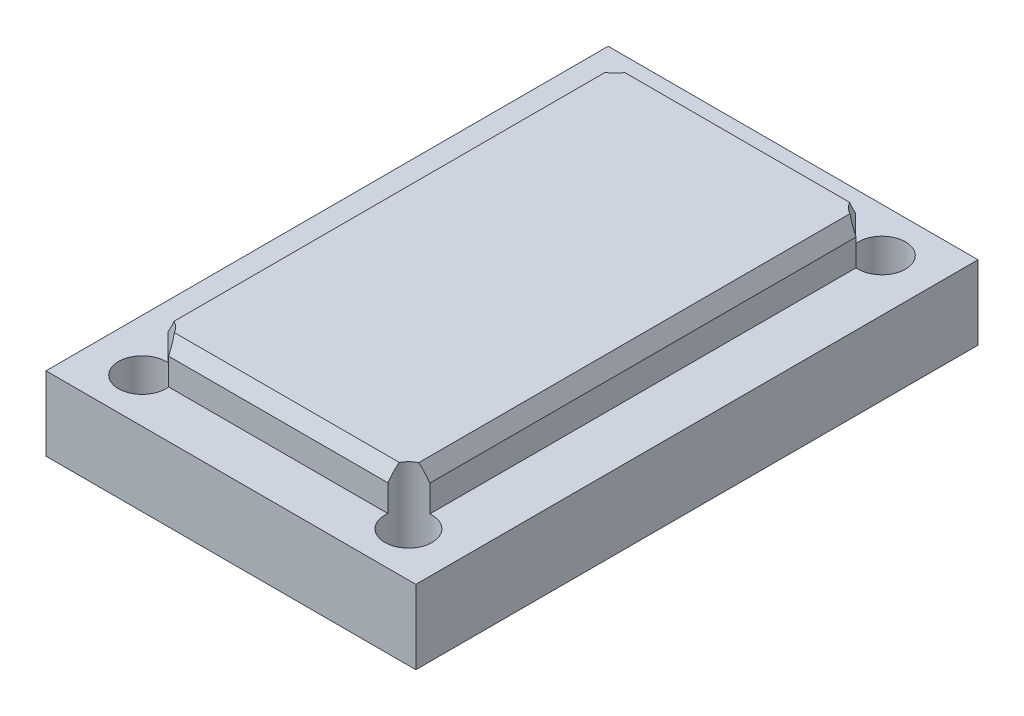
ISO-10303-21;
HEADER;
FILE_DESCRIPTION(('STEP AP214'),'2;1');
FILE_NAME('part.step','',(''),(''),'','','');
FILE_SCHEMA(('AUTOMOTIVE_DESIGN { 1 0 10303 214 1 1 1 1 }'));
ENDSEC;
DATA;
#1=APPLICATION_CONTEXT('core data for automotive mechanical design processes');
#2=APPLICATION_PROTOCOL_DEFINITION('international standard','automotive_design',2000,#1);
#3=PRODUCT_CONTEXT('',#1,'mechanical');
#4=PRODUCT('Part','Part','',(#3));
#5=PRODUCT_RELATED_PRODUCT_CATEGORY('part','',(#4));
#6=PRODUCT_DEFINITION_FORMATION('','',#4);
#7=PRODUCT_DEFINITION_CONTEXT('part definition',#1,'design');
#8=PRODUCT_DEFINITION('design','',#6,#7);
#9=PRODUCT_DEFINITION_SHAPE('','',#8);
#10=(LENGTH_UNIT() NAMED_UNIT(*) SI_UNIT(.MILLI.,.METRE.));
#11=(NAMED_UNIT(*) PLANE_ANGLE_UNIT() SI_UNIT($,.RADIAN.));
#12=(NAMED_UNIT(*) SI_UNIT($,.STERADIAN.) SOLID_ANGLE_UNIT());
#13=UNCERTAINTY_MEASURE_WITH_UNIT(LENGTH_MEASURE(1.E-05),#10,'distance_accuracy_value','');
#14=(GEOMETRIC_REPRESENTATION_CONTEXT(3) GLOBAL_UNCERTAINTY_ASSIGNED_CONTEXT((#13)) GLOBAL_UNIT_ASSIGNED_CONTEXT((#10,
#11,#12)) REPRESENTATION_CONTEXT('',''));
#15=CARTESIAN_POINT('',(0.,0.,0.));
#16=DIRECTION('',(0.,0.,1.));
#17=DIRECTION('',(1.,0.,0.));
#18=AXIS2_PLACEMENT_3D('',#15,#16,#17);
#19=CARTESIAN_POINT('',(0.,5.,0.));
#20=DIRECTION('',(0.,1.,0.));
#21=DIRECTION('',(0.,0.,1.));
#22=AXIS2_PLACEMENT_3D('',#19,#20,#21);
#23=PLANE('',#22);
#24=CARTESIAN_POINT('',(-9.,5.,16.));
#25=DIRECTION('',(0.,1.,0.));
#26=DIRECTION('',(0.,0.,1.));
#27=AXIS2_PLACEMENT_3D('',#24,#25,#26);
#28=CIRCLE('',#27,1.6);
#29=CARTESIAN_POINT('',(-8.85,5.,14.4070467677926));
#30=VERTEX_POINT('',#29);
#31=CARTESIAN_POINT('',(-7.41254921336124,5.,15.8));
#32=VERTEX_POINT('',#31);
#33=EDGE_CURVE('E284',#30,#32,#28,.T.);
#34=ORIENTED_EDGE('',*,*,#33,.F.);
#35=DIRECTION('',(0.,0.,1.));
#36=VECTOR('',#35,1.);
#37=CARTESIAN_POINT('',(-8.85,5.,-15.8));
#38=LINE('',#37,#36);
#39=CARTESIAN_POINT('',(-8.85,5.,-14.4070467677926));
#40=VERTEX_POINT('',#39);
#41=EDGE_CURVE('E301',#40,#30,#38,.T.);
#42=ORIENTED_EDGE('',*,*,#41,.F.);
#43=CARTESIAN_POINT('',(-9.,5.,-16.));
#44=DIRECTION('',(0.,1.,0.));
#45=DIRECTION('',(0.,0.,1.));
#46=AXIS2_PLACEMENT_3D('',#43,#44,#45);
#47=CIRCLE('',#46,1.6);
#48=CARTESIAN_POINT('',(-7.41254921336125,5.,-15.8));
#49=VERTEX_POINT('',#48);
#50=EDGE_CURVE('E174',#49,#40,#47,.T.);
#51=ORIENTED_EDGE('',*,*,#50,.F.);
#52=DIRECTION('',(-1.,0.,0.));
#53=VECTOR('',#52,1.);
#54=CARTESIAN_POINT('',(8.85,5.,-15.8));
#55=LINE('',#54,#53);
#56=CARTESIAN_POINT('',(7.41254921336124,5.,-15.8));
#57=VERTEX_POINT('',#56);
#58=EDGE_CURVE('E152',#57,#49,#55,.T.);
#59=ORIENTED_EDGE('',*,*,#58,.F.);
#60=CARTESIAN_POINT('',(8.99999999999999,5.,-16.));
#61=DIRECTION('',(0.,1.,0.));
#62=DIRECTION('',(0.,0.,1.));
#63=AXIS2_PLACEMENT_3D('',#60,#61,#62);
#64=CIRCLE('',#63,1.6);
#65=CARTESIAN_POINT('',(8.85,5.,-14.4070467677926));
#66=VERTEX_POINT('',#65);
#67=EDGE_CURVE('E157',#66,#57,#64,.T.);
#68=ORIENTED_EDGE('',*,*,#67,.F.);
#69=DIRECTION('',(0.,0.,-1.));
#70=VECTOR('',#69,1.);
#71=CARTESIAN_POINT('',(8.85,5.,-15.8));
#72=LINE('',#71,#70);
#73=CARTESIAN_POINT('',(8.85,5.,14.4070467677926));
#74=VERTEX_POINT('',#73);
#75=EDGE_CURVE('E176',#74,#66,#72,.T.);
#76=ORIENTED_EDGE('',*,*,#75,.F.);
#77=CARTESIAN_POINT('',(9.,5.,16.));
#78=DIRECTION('',(0.,1.,0.));
#79=DIRECTION('',(0.,0.,1.));
#80=AXIS2_PLACEMENT_3D('',#77,#78,#79);
#81=CIRCLE('',#80,1.6);
#82=CARTESIAN_POINT('',(7.41254921336124,5.,15.8));
#83=VERTEX_POINT('',#82);
#84=EDGE_CURVE('E296',#83,#74,#81,.T.);
#85=ORIENTED_EDGE('',*,*,#84,.F.);
#86=DIRECTION('',(1.,0.,0.));
#87=VECTOR('',#86,1.);
#88=CARTESIAN_POINT('',(8.85,5.,15.8));
#89=LINE('',#88,#87);
#90=EDGE_CURVE('E181',#32,#83,#89,.T.);
#91=ORIENTED_EDGE('',*,*,#90,.F.);
#92=EDGE_LOOP('',(#34,#42,#51,#59,#68,#76,#85,#91));
#93=FACE_BOUND('',#92,.T.);
#94=DIRECTION('',(0.,0.,1.));
#95=VECTOR('',#94,1.);
#96=CARTESIAN_POINT('',(-12.5,5.,19.));
#97=LINE('',#96,#95);
#98=CARTESIAN_POINT('',(-12.5,5.,-19.));
#99=VERTEX_POINT('',#98);
#100=CARTESIAN_POINT('',(-12.5,5.,19.));
#101=VERTEX_POINT('',#100);
#102=EDGE_CURVE('E185',#99,#101,#97,.T.);
#103=ORIENTED_EDGE('',*,*,#102,.T.);
#104=DIRECTION('',(1.,0.,0.));
#105=VECTOR('',#104,1.);
#106=CARTESIAN_POINT('',(12.5,5.,19.));
#107=LINE('',#106,#105);
#108=CARTESIAN_POINT('',(12.5,5.,19.));
#109=VERTEX_POINT('',#108);
#110=EDGE_CURVE('E188',#101,#109,#107,.T.);
#111=ORIENTED_EDGE('',*,*,#110,.T.);
#112=DIRECTION('',(0.,0.,-1.));
#113=VECTOR('',#112,1.);
#114=CARTESIAN_POINT('',(12.5,5.,19.));
#115=LINE('',#114,#113);
#116=CARTESIAN_POINT('',(12.5,5.,-19.));
#117=VERTEX_POINT('',#116);
#118=EDGE_CURVE('E191',#109,#117,#115,.T.);
#119=ORIENTED_EDGE('',*,*,#118,.T.);
#120=DIRECTION('',(-1.,0.,0.));
#121=VECTOR('',#120,1.);
#122=CARTESIAN_POINT('',(12.5,5.,-19.));
#123=LINE('',#122,#121);
#124=EDGE_CURVE('E193',#117,#99,#123,.T.);
#125=ORIENTED_EDGE('',*,*,#124,.T.);
#126=EDGE_LOOP('',(#103,#111,#119,#125));
#127=FACE_BOUND('',#126,.T.);
#128=ADVANCED_FACE('F35',(#93,#127),#23,.T.);
#129=CARTESIAN_POINT('',(-12.5,5.,19.));
#130=DIRECTION('',(1.,0.,0.));
#131=DIRECTION('',(0.,0.,-1.));
#132=AXIS2_PLACEMENT_3D('',#129,#130,#131);
#133=PLANE('',#132);
#134=DIRECTION('',(0.,0.,1.));
#135=VECTOR('',#134,1.);
#136=CARTESIAN_POINT('',(-12.5,0.,19.));
#137=LINE('',#136,#135);
#138=CARTESIAN_POINT('',(-12.5,0.,-19.));
#139=VERTEX_POINT('',#138);
#140=CARTESIAN_POINT('',(-12.5,0.,19.));
#141=VERTEX_POINT('',#140);
#142=EDGE_CURVE('E175',#139,#141,#137,.T.);
#143=ORIENTED_EDGE('',*,*,#142,.T.);
#144=DIRECTION('',(0.,-1.,0.));
#145=VECTOR('',#144,1.);
#146=CARTESIAN_POINT('',(-12.5,5.,19.));
#147=LINE('',#146,#145);
#148=EDGE_CURVE('E208',#101,#141,#147,.T.);
#149=ORIENTED_EDGE('',*,*,#148,.F.);
#150=ORIENTED_EDGE('',*,*,#102,.F.);
#151=DIRECTION('',(0.,-1.,0.));
#152=VECTOR('',#151,1.);
#153=CARTESIAN_POINT('',(-12.5,5.,-19.));
#154=LINE('',#153,#152);
#155=EDGE_CURVE('E194',#99,#139,#154,.T.);
#156=ORIENTED_EDGE('',*,*,#155,.T.);
#157=EDGE_LOOP('',(#143,#149,#150,#156));
#158=FACE_BOUND('',#157,.T.);
#159=ADVANCED_FACE('F328',(#158),#133,.F.);
#160=CARTESIAN_POINT('',(12.5,5.,19.));
#161=DIRECTION('',(0.,0.,-1.));
#162=DIRECTION('',(-1.,0.,0.));
#163=AXIS2_PLACEMENT_3D('',#160,#161,#162);
#164=PLANE('',#163);
#165=DIRECTION('',(1.,0.,0.));
#166=VECTOR('',#165,1.);
#167=CARTESIAN_POINT('',(12.5,0.,19.));
#168=LINE('',#167,#166);
#169=CARTESIAN_POINT('',(12.5,0.,19.));
#170=VERTEX_POINT('',#169);
#171=EDGE_CURVE('E179',#141,#170,#168,.T.);
#172=ORIENTED_EDGE('',*,*,#171,.T.);
#173=DIRECTION('',(0.,-1.,0.));
#174=VECTOR('',#173,1.);
#175=CARTESIAN_POINT('',(12.5,5.,19.));
#176=LINE('',#175,#174);
#177=EDGE_CURVE('E205',#109,#170,#176,.T.);
#178=ORIENTED_EDGE('',*,*,#177,.F.);
#179=ORIENTED_EDGE('',*,*,#110,.F.);
#180=ORIENTED_EDGE('',*,*,#148,.T.);
#181=EDGE_LOOP('',(#172,#178,#179,#180));
#182=FACE_BOUND('',#181,.T.);
#183=ADVANCED_FACE('F333',(#182),#164,.F.);
#184=CARTESIAN_POINT('',(12.5,5.,19.));
#185=DIRECTION('',(-1.,0.,0.));
#186=DIRECTION('',(0.,0.,1.));
#187=AXIS2_PLACEMENT_3D('',#184,#185,#186);
#188=PLANE('',#187);
#189=DIRECTION('',(0.,0.,-1.));
#190=VECTOR('',#189,1.);
#191=CARTESIAN_POINT('',(12.5,0.,19.));
#192=LINE('',#191,#190);
#193=CARTESIAN_POINT('',(12.5,0.,-19.));
#194=VERTEX_POINT('',#193);
#195=EDGE_CURVE('E197',#170,#194,#192,.T.);
#196=ORIENTED_EDGE('',*,*,#195,.T.);
#197=DIRECTION('',(0.,-1.,0.));
#198=VECTOR('',#197,1.);
#199=CARTESIAN_POINT('',(12.5,5.,-19.));
#200=LINE('',#199,#198);
#201=EDGE_CURVE('E202',#117,#194,#200,.T.);
#202=ORIENTED_EDGE('',*,*,#201,.F.);
#203=ORIENTED_EDGE('',*,*,#118,.F.);
#204=ORIENTED_EDGE('',*,*,#177,.T.);
#205=EDGE_LOOP('',(#196,#202,#203,#204));
#206=FACE_BOUND('',#205,.T.);
#207=ADVANCED_FACE('F346',(#206),#188,.F.);
#208=CARTESIAN_POINT('',(12.5,5.,-19.));
#209=DIRECTION('',(0.,0.,1.));
#210=DIRECTION('',(1.,0.,0.));
#211=AXIS2_PLACEMENT_3D('',#208,#209,#210);
#212=PLANE('',#211);
#213=DIRECTION('',(-1.,0.,0.));
#214=VECTOR('',#213,1.);
#215=CARTESIAN_POINT('',(12.5,0.,-19.));
#216=LINE('',#215,#214);
#217=EDGE_CURVE('E189',#194,#139,#216,.T.);
#218=ORIENTED_EDGE('',*,*,#217,.T.);
#219=ORIENTED_EDGE('',*,*,#155,.F.);
#220=ORIENTED_EDGE('',*,*,#124,.F.);
#221=ORIENTED_EDGE('',*,*,#201,.T.);
#222=EDGE_LOOP('',(#218,#219,#220,#221));
#223=FACE_BOUND('',#222,.T.);
#224=ADVANCED_FACE('F342',(#223),#212,.F.);
#225=CARTESIAN_POINT('',(0.,0.,0.));
#226=DIRECTION('',(0.,1.,0.));
#227=DIRECTION('',(0.,0.,1.));
#228=AXIS2_PLACEMENT_3D('',#225,#226,#227);
#229=PLANE('',#228);
#230=CARTESIAN_POINT('',(-9.,0.,16.));
#231=DIRECTION('',(0.,1.,0.));
#232=DIRECTION('',(0.,0.,1.));
#233=AXIS2_PLACEMENT_3D('',#230,#231,#232);
#234=CIRCLE('',#233,1.6);
#235=CARTESIAN_POINT('',(-9.,0.,17.6));
#236=VERTEX_POINT('',#235);
#237=EDGE_CURVE('E158',#236,#236,#234,.T.);
#238=ORIENTED_EDGE('',*,*,#237,.T.);
#239=EDGE_LOOP('',(#238));
#240=FACE_BOUND('',#239,.T.);
#241=CARTESIAN_POINT('',(-9.,0.,-16.));
#242=DIRECTION('',(0.,1.,0.));
#243=DIRECTION('',(0.,0.,1.));
#244=AXIS2_PLACEMENT_3D('',#241,#242,#243);
#245=CIRCLE('',#244,1.6);
#246=CARTESIAN_POINT('',(-9.,0.,-14.4));
#247=VERTEX_POINT('',#246);
#248=EDGE_CURVE('E266',#247,#247,#245,.T.);
#249=ORIENTED_EDGE('',*,*,#248,.T.);
#250=EDGE_LOOP('',(#249));
#251=FACE_BOUND('',#250,.T.);
#252=CARTESIAN_POINT('',(8.99999999999999,0.,-16.));
#253=DIRECTION('',(0.,1.,0.));
#254=DIRECTION('',(0.,0.,1.));
#255=AXIS2_PLACEMENT_3D('',#252,#253,#254);
#256=CIRCLE('',#255,1.6);
#257=CARTESIAN_POINT('',(8.99999999999999,0.,-14.4));
#258=VERTEX_POINT('',#257);
#259=EDGE_CURVE('E273',#258,#258,#256,.T.);
#260=ORIENTED_EDGE('',*,*,#259,.T.);
#261=EDGE_LOOP('',(#260));
#262=FACE_BOUND('',#261,.T.);
#263=CARTESIAN_POINT('',(9.,0.,16.));
#264=DIRECTION('',(0.,1.,0.));
#265=DIRECTION('',(0.,0.,1.));
#266=AXIS2_PLACEMENT_3D('',#263,#264,#265);
#267=CIRCLE('',#266,1.6);
#268=CARTESIAN_POINT('',(9.,0.,17.6));
#269=VERTEX_POINT('',#268);
#270=EDGE_CURVE('E291',#269,#269,#267,.T.);
#271=ORIENTED_EDGE('',*,*,#270,.T.);
#272=EDGE_LOOP('',(#271));
#273=FACE_BOUND('',#272,.T.);
#274=ORIENTED_EDGE('',*,*,#142,.F.);
#275=ORIENTED_EDGE('',*,*,#217,.F.);
#276=ORIENTED_EDGE('',*,*,#195,.F.);
#277=ORIENTED_EDGE('',*,*,#171,.F.);
#278=EDGE_LOOP('',(#274,#275,#276,#277));
#279=FACE_BOUND('',#278,.T.);
#280=ADVANCED_FACE('F339',(#240,#251,#262,#273,#279),#229,.F.);
#281=CARTESIAN_POINT('',(-8.85,7.8,-15.8));
#282=DIRECTION('',(1.,0.,0.));
#283=DIRECTION('',(0.,0.,-1.));
#284=AXIS2_PLACEMENT_3D('',#281,#282,#283);
#285=PLANE('',#284);
#286=DIRECTION('',(0.,1.,0.));
#287=VECTOR('',#286,1.);
#288=CARTESIAN_POINT('',(-8.85,0.,14.4070467677926));
#289=LINE('',#288,#287);
#290=CARTESIAN_POINT('',(-8.85,6.79999999999999,14.4070467677926));
#291=VERTEX_POINT('',#290);
#292=EDGE_CURVE('E246',#30,#291,#289,.T.);
#293=ORIENTED_EDGE('',*,*,#292,.T.);
#294=DIRECTION('',(0.,0.,-1.));
#295=VECTOR('',#294,1.);
#296=CARTESIAN_POINT('',(-8.85,6.79999999999999,-15.8));
#297=LINE('',#296,#295);
#298=CARTESIAN_POINT('',(-8.85,6.79999999999999,-14.4070467677926));
#299=VERTEX_POINT('',#298);
#300=EDGE_CURVE('E43',#291,#299,#297,.T.);
#301=ORIENTED_EDGE('',*,*,#300,.T.);
#302=DIRECTION('',(0.,1.,0.));
#303=VECTOR('',#302,1.);
#304=CARTESIAN_POINT('',(-8.85,0.,-14.4070467677926));
#305=LINE('',#304,#303);
#306=EDGE_CURVE('E245',#299,#40,#305,.F.);
#307=ORIENTED_EDGE('',*,*,#306,.T.);
#308=ORIENTED_EDGE('',*,*,#41,.T.);
#309=EDGE_LOOP('',(#293,#301,#307,#308));
#310=FACE_BOUND('',#309,.T.);
#311=ADVANCED_FACE('F243',(#310),#285,.F.);
#312=CARTESIAN_POINT('',(8.85,7.8,15.8));
#313=DIRECTION('',(0.,0.,-1.));
#314=DIRECTION('',(-1.,0.,0.));
#315=AXIS2_PLACEMENT_3D('',#312,#313,#314);
#316=PLANE('',#315);
#317=DIRECTION('',(0.,1.,0.));
#318=VECTOR('',#317,1.);
#319=CARTESIAN_POINT('',(7.41254921336124,0.,15.8));
#320=LINE('',#319,#318);
#321=CARTESIAN_POINT('',(7.41254921336124,6.8,15.8));
#322=VERTEX_POINT('',#321);
#323=EDGE_CURVE('E299',#83,#322,#320,.T.);
#324=ORIENTED_EDGE('',*,*,#323,.T.);
#325=DIRECTION('',(-1.,0.,0.));
#326=VECTOR('',#325,1.);
#327=CARTESIAN_POINT('',(8.85,6.8,15.8));
#328=LINE('',#327,#326);
#329=CARTESIAN_POINT('',(-7.41254921336124,6.8,15.8));
#330=VERTEX_POINT('',#329);
#331=EDGE_CURVE('E11',#322,#330,#328,.T.);
#332=ORIENTED_EDGE('',*,*,#331,.T.);
#333=DIRECTION('',(0.,1.,0.));
#334=VECTOR('',#333,1.);
#335=CARTESIAN_POINT('',(-7.41254921336124,0.,15.8));
#336=LINE('',#335,#334);
#337=EDGE_CURVE('E253',#330,#32,#336,.F.);
#338=ORIENTED_EDGE('',*,*,#337,.T.);
#339=ORIENTED_EDGE('',*,*,#90,.T.);
#340=EDGE_LOOP('',(#324,#332,#338,#339));
#341=FACE_BOUND('',#340,.T.);
#342=ADVANCED_FACE('F304',(#341),#316,.F.);
#343=CARTESIAN_POINT('',(8.85,7.8,-15.8));
#344=DIRECTION('',(-1.,0.,0.));
#345=DIRECTION('',(0.,0.,1.));
#346=AXIS2_PLACEMENT_3D('',#343,#344,#345);
#347=PLANE('',#346);
#348=DIRECTION('',(0.,1.,0.));
#349=VECTOR('',#348,1.);
#350=CARTESIAN_POINT('',(8.85,0.,-14.4070467677926));
#351=LINE('',#350,#349);
#352=CARTESIAN_POINT('',(8.85,6.8,-14.4070467677926));
#353=VERTEX_POINT('',#352);
#354=EDGE_CURVE('E164',#66,#353,#351,.T.);
#355=ORIENTED_EDGE('',*,*,#354,.T.);
#356=DIRECTION('',(0.,0.,1.));
#357=VECTOR('',#356,1.);
#358=CARTESIAN_POINT('',(8.85,6.8,-15.8));
#359=LINE('',#358,#357);
#360=CARTESIAN_POINT('',(8.85,6.8,14.4070467677926));
#361=VERTEX_POINT('',#360);
#362=EDGE_CURVE('E227',#353,#361,#359,.T.);
#363=ORIENTED_EDGE('',*,*,#362,.T.);
#364=DIRECTION('',(0.,1.,0.));
#365=VECTOR('',#364,1.);
#366=CARTESIAN_POINT('',(8.85,0.,14.4070467677926));
#367=LINE('',#366,#365);
#368=EDGE_CURVE('E294',#361,#74,#367,.F.);
#369=ORIENTED_EDGE('',*,*,#368,.T.);
#370=ORIENTED_EDGE('',*,*,#75,.T.);
#371=EDGE_LOOP('',(#355,#363,#369,#370));
#372=FACE_BOUND('',#371,.T.);
#373=ADVANCED_FACE('F310',(#372),#347,.F.);
#374=CARTESIAN_POINT('',(8.85,7.8,-15.8));
#375=DIRECTION('',(0.,0.,1.));
#376=DIRECTION('',(1.,0.,0.));
#377=AXIS2_PLACEMENT_3D('',#374,#375,#376);
#378=PLANE('',#377);
#379=DIRECTION('',(0.,1.,0.));
#380=VECTOR('',#379,1.);
#381=CARTESIAN_POINT('',(-7.41254921336125,0.,-15.8));
#382=LINE('',#381,#380);
#383=CARTESIAN_POINT('',(-7.41254921336125,6.8,-15.8));
#384=VERTEX_POINT('',#383);
#385=EDGE_CURVE('E280',#49,#384,#382,.T.);
#386=ORIENTED_EDGE('',*,*,#385,.T.);
#387=DIRECTION('',(1.,0.,0.));
#388=VECTOR('',#387,1.);
#389=CARTESIAN_POINT('',(8.85,6.8,-15.8));
#390=LINE('',#389,#388);
#391=CARTESIAN_POINT('',(7.41254921336124,6.8,-15.8));
#392=VERTEX_POINT('',#391);
#393=EDGE_CURVE('E154',#384,#392,#390,.T.);
#394=ORIENTED_EDGE('',*,*,#393,.T.);
#395=DIRECTION('',(0.,1.,0.));
#396=VECTOR('',#395,1.);
#397=CARTESIAN_POINT('',(7.41254921336124,0.,-15.8));
#398=LINE('',#397,#396);
#399=EDGE_CURVE('E147',#392,#57,#398,.F.);
#400=ORIENTED_EDGE('',*,*,#399,.T.);
#401=ORIENTED_EDGE('',*,*,#58,.T.);
#402=EDGE_LOOP('',(#386,#394,#400,#401));
#403=FACE_BOUND('',#402,.T.);
#404=ADVANCED_FACE('F150',(#403),#378,.F.);
#405=CARTESIAN_POINT('',(0.,7.8,0.));
#406=DIRECTION('',(0.,-1.,0.));
#407=DIRECTION('',(0.,0.,-1.));
#408=AXIS2_PLACEMENT_3D('',#405,#406,#407);
#409=PLANE('',#408);
#410=CARTESIAN_POINT('',(9.,7.8,16.));
#411=DIRECTION('',(0.,1.,0.));
#412=DIRECTION('',(0.,0.,1.));
#413=AXIS2_PLACEMENT_3D('',#410,#411,#412);
#414=CIRCLE('',#413,1.6);
#415=CARTESIAN_POINT('',(8.27264973081038,7.8,14.5748819045743));
#416=VERTEX_POINT('',#415);
#417=CARTESIAN_POINT('',(7.60152706175956,7.8,15.2226497308104));
#418=VERTEX_POINT('',#417);
#419=EDGE_CURVE('E288',#416,#418,#414,.T.);
#420=ORIENTED_EDGE('',*,*,#419,.F.);
#421=DIRECTION('',(0.,0.,-1.));
#422=VECTOR('',#421,1.);
#423=CARTESIAN_POINT('',(8.27264973081038,7.8,0.));
#424=LINE('',#423,#422);
#425=CARTESIAN_POINT('',(8.27264973081037,7.8,-14.5748819045743));
#426=VERTEX_POINT('',#425);
#427=EDGE_CURVE('E220',#416,#426,#424,.T.);
#428=ORIENTED_EDGE('',*,*,#427,.T.);
#429=CARTESIAN_POINT('',(8.99999999999999,7.8,-16.));
#430=DIRECTION('',(0.,1.,0.));
#431=DIRECTION('',(0.,0.,1.));
#432=AXIS2_PLACEMENT_3D('',#429,#430,#431);
#433=CIRCLE('',#432,1.6);
#434=CARTESIAN_POINT('',(7.60152706175957,7.8,-15.2226497308104));
#435=VERTEX_POINT('',#434);
#436=EDGE_CURVE('E275',#435,#426,#433,.T.);
#437=ORIENTED_EDGE('',*,*,#436,.F.);
#438=DIRECTION('',(-1.,0.,0.));
#439=VECTOR('',#438,1.);
#440=CARTESIAN_POINT('',(0.,7.8,-15.2226497308104));
#441=LINE('',#440,#439);
#442=CARTESIAN_POINT('',(-7.60152706175957,7.8,-15.2226497308104));
#443=VERTEX_POINT('',#442);
#444=EDGE_CURVE('E217',#435,#443,#441,.T.);
#445=ORIENTED_EDGE('',*,*,#444,.T.);
#446=CARTESIAN_POINT('',(-9.,7.8,-16.));
#447=DIRECTION('',(0.,1.,0.));
#448=DIRECTION('',(0.,0.,1.));
#449=AXIS2_PLACEMENT_3D('',#446,#447,#448);
#450=CIRCLE('',#449,1.6);
#451=CARTESIAN_POINT('',(-8.27264973081037,7.8,-14.5748819045743));
#452=VERTEX_POINT('',#451);
#453=EDGE_CURVE('E263',#452,#443,#450,.T.);
#454=ORIENTED_EDGE('',*,*,#453,.F.);
#455=DIRECTION('',(0.,0.,1.));
#456=VECTOR('',#455,1.);
#457=CARTESIAN_POINT('',(-8.27264973081037,7.8,0.));
#458=LINE('',#457,#456);
#459=CARTESIAN_POINT('',(-8.27264973081037,7.8,14.5748819045743));
#460=VERTEX_POINT('',#459);
#461=EDGE_CURVE('E214',#452,#460,#458,.T.);
#462=ORIENTED_EDGE('',*,*,#461,.T.);
#463=CARTESIAN_POINT('',(-9.,7.8,16.));
#464=DIRECTION('',(0.,1.,0.));
#465=DIRECTION('',(0.,0.,1.));
#466=AXIS2_PLACEMENT_3D('',#463,#464,#465);
#467=CIRCLE('',#466,1.6);
#468=CARTESIAN_POINT('',(-7.60152706175956,7.8,15.2226497308104));
#469=VERTEX_POINT('',#468);
#470=EDGE_CURVE('E261',#469,#460,#467,.T.);
#471=ORIENTED_EDGE('',*,*,#470,.F.);
#472=DIRECTION('',(1.,0.,0.));
#473=VECTOR('',#472,1.);
#474=CARTESIAN_POINT('',(0.,7.8,15.2226497308104));
#475=LINE('',#474,#473);
#476=EDGE_CURVE('E211',#469,#418,#475,.T.);
#477=ORIENTED_EDGE('',*,*,#476,.T.);
#478=EDGE_LOOP('',(#420,#428,#437,#445,#454,#462,#471,#477));
#479=FACE_BOUND('',#478,.T.);
#480=ADVANCED_FACE('F260',(#479),#409,.F.);
#481=CARTESIAN_POINT('',(9.,0.,16.));
#482=DIRECTION('',(0.,1.,0.));
#483=DIRECTION('',(0.,0.,1.));
#484=AXIS2_PLACEMENT_3D('',#481,#482,#483);
#485=CYLINDRICAL_SURFACE('',#484,1.6);
#486=ORIENTED_EDGE('',*,*,#270,.F.);
#487=EDGE_LOOP('',(#486));
#488=FACE_BOUND('',#487,.T.);
#489=ORIENTED_EDGE('',*,*,#368,.F.);
#490=CARTESIAN_POINT('',(9.,6.54019237886467,16.));
#491=DIRECTION('',(-0.86602540378444,-0.499999999999998,0.));
#492=DIRECTION('',(-0.499999999999998,0.86602540378444,0.));
#493=AXIS2_PLACEMENT_3D('',#490,#491,#492);
#494=ELLIPSE('',#493,3.20000000000002,1.6);
#495=EDGE_CURVE('E231',#361,#416,#494,.F.);
#496=ORIENTED_EDGE('',*,*,#495,.T.);
#497=ORIENTED_EDGE('',*,*,#419,.T.);
#498=CARTESIAN_POINT('',(9.,6.45358983848623,16.));
#499=DIRECTION('',(0.,-0.499999999999998,-0.86602540378444));
#500=DIRECTION('',(0.,0.86602540378444,-0.499999999999998));
#501=AXIS2_PLACEMENT_3D('',#498,#499,#500);
#502=ELLIPSE('',#501,3.20000000000002,1.6);
#503=EDGE_CURVE('E229',#418,#322,#502,.F.);
#504=ORIENTED_EDGE('',*,*,#503,.T.);
#505=ORIENTED_EDGE('',*,*,#323,.F.);
#506=ORIENTED_EDGE('',*,*,#84,.T.);
#507=EDGE_LOOP('',(#489,#496,#497,#504,#505,#506));
#508=FACE_BOUND('',#507,.T.);
#509=ADVANCED_FACE('F308',(#488,#508),#485,.F.);
#510=CARTESIAN_POINT('',(8.99999999999999,0.,-16.));
#511=DIRECTION('',(0.,1.,0.));
#512=DIRECTION('',(0.,0.,1.));
#513=AXIS2_PLACEMENT_3D('',#510,#511,#512);
#514=CYLINDRICAL_SURFACE('',#513,1.6);
#515=ORIENTED_EDGE('',*,*,#259,.F.);
#516=EDGE_LOOP('',(#515));
#517=FACE_BOUND('',#516,.T.);
#518=ORIENTED_EDGE('',*,*,#436,.T.);
#519=CARTESIAN_POINT('',(8.99999999999999,6.54019237886467,-16.));
#520=DIRECTION('',(-0.86602540378444,-0.499999999999998,0.));
#521=DIRECTION('',(-0.499999999999998,0.86602540378444,0.));
#522=AXIS2_PLACEMENT_3D('',#519,#520,#521);
#523=ELLIPSE('',#522,3.20000000000002,1.6);
#524=EDGE_CURVE('E225',#426,#353,#523,.F.);
#525=ORIENTED_EDGE('',*,*,#524,.T.);
#526=ORIENTED_EDGE('',*,*,#354,.F.);
#527=ORIENTED_EDGE('',*,*,#67,.T.);
#528=ORIENTED_EDGE('',*,*,#399,.F.);
#529=CARTESIAN_POINT('',(8.99999999999999,6.45358983848622,-16.));
#530=DIRECTION('',(0.,-0.5,0.866025403784439));
#531=DIRECTION('',(0.,0.866025403784439,0.5));
#532=AXIS2_PLACEMENT_3D('',#529,#530,#531);
#533=ELLIPSE('',#532,3.2,1.6);
#534=EDGE_CURVE('E223',#392,#435,#533,.F.);
#535=ORIENTED_EDGE('',*,*,#534,.T.);
#536=EDGE_LOOP('',(#518,#525,#526,#527,#528,#535));
#537=FACE_BOUND('',#536,.T.);
#538=ADVANCED_FACE('F162',(#517,#537),#514,.F.);
#539=CARTESIAN_POINT('',(-9.,0.,-16.));
#540=DIRECTION('',(0.,1.,0.));
#541=DIRECTION('',(0.,0.,1.));
#542=AXIS2_PLACEMENT_3D('',#539,#540,#541);
#543=CYLINDRICAL_SURFACE('',#542,1.6);
#544=ORIENTED_EDGE('',*,*,#248,.F.);
#545=EDGE_LOOP('',(#544));
#546=FACE_BOUND('',#545,.T.);
#547=ORIENTED_EDGE('',*,*,#453,.T.);
#548=CARTESIAN_POINT('',(-9.,6.45358983848621,-16.));
#549=DIRECTION('',(0.,-0.5,0.866025403784439));
#550=DIRECTION('',(0.,0.866025403784439,0.5));
#551=AXIS2_PLACEMENT_3D('',#548,#549,#550);
#552=ELLIPSE('',#551,3.2,1.6);
#553=EDGE_CURVE('E235',#443,#384,#552,.F.);
#554=ORIENTED_EDGE('',*,*,#553,.T.);
#555=ORIENTED_EDGE('',*,*,#385,.F.);
#556=ORIENTED_EDGE('',*,*,#50,.T.);
#557=ORIENTED_EDGE('',*,*,#306,.F.);
#558=CARTESIAN_POINT('',(-9.,6.54019237886466,-16.));
#559=DIRECTION('',(0.866025403784439,-0.5,0.));
#560=DIRECTION('',(0.5,0.866025403784439,0.));
#561=AXIS2_PLACEMENT_3D('',#558,#559,#560);
#562=ELLIPSE('',#561,3.20000000000001,1.6);
#563=EDGE_CURVE('E233',#299,#452,#562,.F.);
#564=ORIENTED_EDGE('',*,*,#563,.T.);
#565=EDGE_LOOP('',(#547,#554,#555,#556,#557,#564));
#566=FACE_BOUND('',#565,.T.);
#567=ADVANCED_FACE('F251',(#546,#566),#543,.F.);
#568=CARTESIAN_POINT('',(-9.,0.,16.));
#569=DIRECTION('',(0.,1.,0.));
#570=DIRECTION('',(0.,0.,1.));
#571=AXIS2_PLACEMENT_3D('',#568,#569,#570);
#572=CYLINDRICAL_SURFACE('',#571,1.6);
#573=ORIENTED_EDGE('',*,*,#237,.F.);
#574=EDGE_LOOP('',(#573));
#575=FACE_BOUND('',#574,.T.);
#576=ORIENTED_EDGE('',*,*,#470,.T.);
#577=CARTESIAN_POINT('',(-9.,6.54019237886466,16.));
#578=DIRECTION('',(0.866025403784439,-0.5,0.));
#579=DIRECTION('',(0.5,0.866025403784439,0.));
#580=AXIS2_PLACEMENT_3D('',#577,#578,#579);
#581=ELLIPSE('',#580,3.20000000000001,1.6);
#582=EDGE_CURVE('E50',#460,#291,#581,.F.);
#583=ORIENTED_EDGE('',*,*,#582,.T.);
#584=ORIENTED_EDGE('',*,*,#292,.F.);
#585=ORIENTED_EDGE('',*,*,#33,.T.);
#586=ORIENTED_EDGE('',*,*,#337,.F.);
#587=CARTESIAN_POINT('',(-9.,6.45358983848624,16.));
#588=DIRECTION('',(0.,-0.499999999999998,-0.86602540378444));
#589=DIRECTION('',(0.,0.86602540378444,-0.499999999999998));
#590=AXIS2_PLACEMENT_3D('',#587,#588,#589);
#591=ELLIPSE('',#590,3.20000000000002,1.6);
#592=EDGE_CURVE('E238',#330,#469,#591,.F.);
#593=ORIENTED_EDGE('',*,*,#592,.T.);
#594=EDGE_LOOP('',(#576,#583,#584,#585,#586,#593));
#595=FACE_BOUND('',#594,.T.);
#596=ADVANCED_FACE('F264',(#575,#595),#572,.F.);
#597=CARTESIAN_POINT('',(8.27264973081038,7.8,0.));
#598=DIRECTION('',(-0.86602540378444,-0.499999999999998,0.));
#599=DIRECTION('',(0.,0.,-1.));
#600=AXIS2_PLACEMENT_3D('',#597,#598,#599);
#601=PLANE('',#600);
#602=ORIENTED_EDGE('',*,*,#495,.F.);
#603=ORIENTED_EDGE('',*,*,#362,.F.);
#604=ORIENTED_EDGE('',*,*,#524,.F.);
#605=ORIENTED_EDGE('',*,*,#427,.F.);
#606=EDGE_LOOP('',(#602,#603,#604,#605));
#607=FACE_BOUND('',#606,.T.);
#608=ADVANCED_FACE('F315',(#607),#601,.F.);
#609=CARTESIAN_POINT('',(0.,7.8,-15.2226497308104));
#610=DIRECTION('',(0.,-0.5,0.866025403784439));
#611=DIRECTION('',(-1.,0.,0.));
#612=AXIS2_PLACEMENT_3D('',#609,#610,#611);
#613=PLANE('',#612);
#614=ORIENTED_EDGE('',*,*,#534,.F.);
#615=ORIENTED_EDGE('',*,*,#393,.F.);
#616=ORIENTED_EDGE('',*,*,#553,.F.);
#617=ORIENTED_EDGE('',*,*,#444,.F.);
#618=EDGE_LOOP('',(#614,#615,#616,#617));
#619=FACE_BOUND('',#618,.T.);
#620=ADVANCED_FACE('F319',(#619),#613,.F.);
#621=CARTESIAN_POINT('',(-8.27264973081037,7.8,0.));
#622=DIRECTION('',(0.866025403784439,-0.5,0.));
#623=DIRECTION('',(0.,0.,1.));
#624=AXIS2_PLACEMENT_3D('',#621,#622,#623);
#625=PLANE('',#624);
#626=ORIENTED_EDGE('',*,*,#563,.F.);
#627=ORIENTED_EDGE('',*,*,#300,.F.);
#628=ORIENTED_EDGE('',*,*,#582,.F.);
#629=ORIENTED_EDGE('',*,*,#461,.F.);
#630=EDGE_LOOP('',(#626,#627,#628,#629));
#631=FACE_BOUND('',#630,.T.);
#632=ADVANCED_FACE('F256',(#631),#625,.F.);
#633=CARTESIAN_POINT('',(0.,7.8,15.2226497308104));
#634=DIRECTION('',(0.,-0.499999999999998,-0.86602540378444));
#635=DIRECTION('',(1.,0.,0.));
#636=AXIS2_PLACEMENT_3D('',#633,#634,#635);
#637=PLANE('',#636);
#638=ORIENTED_EDGE('',*,*,#592,.F.);
#639=ORIENTED_EDGE('',*,*,#331,.F.);
#640=ORIENTED_EDGE('',*,*,#503,.F.);
#641=ORIENTED_EDGE('',*,*,#476,.F.);
#642=EDGE_LOOP('',(#638,#639,#640,#641));
#643=FACE_BOUND('',#642,.T.);
#644=ADVANCED_FACE('F37',(#643),#637,.F.);
#645=CLOSED_SHELL('',(#128,#159,#183,#207,#224,#280,#311,#342,#373,#404,#480,#509,#538,#567,
#596,#608,#620,#632,#644));
#646=MANIFOLD_SOLID_BREP('B2',#645);
#647=ADVANCED_BREP_SHAPE_REPRESENTATION('',(#18,#646),#14);
#648=SHAPE_DEFINITION_REPRESENTATION(#9,#647);
ENDSEC;
END-ISO-10303-21;
